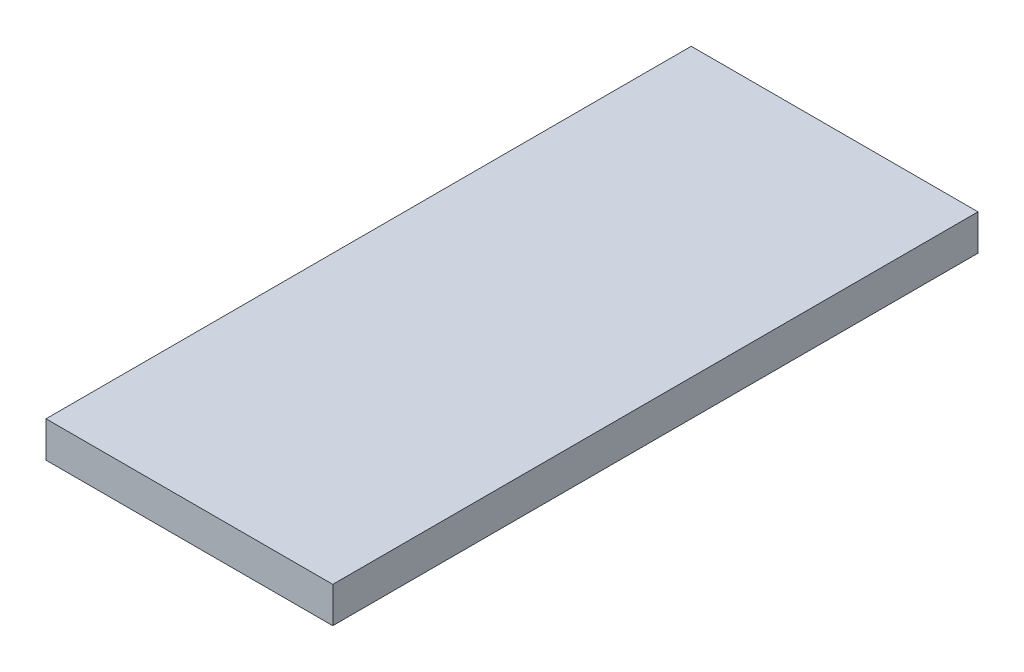
ISO-10303-21;
HEADER;
FILE_DESCRIPTION(('STEP AP214'),'2;1');
FILE_NAME('part.step','',(''),(''),'','','');
FILE_SCHEMA(('AUTOMOTIVE_DESIGN { 1 0 10303 214 1 1 1 1 }'));
ENDSEC;
DATA;
#1=APPLICATION_CONTEXT('core data for automotive mechanical design processes');
#2=APPLICATION_PROTOCOL_DEFINITION('international standard','automotive_design',2000,#1);
#3=PRODUCT_CONTEXT('',#1,'mechanical');
#4=PRODUCT('Part','Part','',(#3));
#5=PRODUCT_RELATED_PRODUCT_CATEGORY('part','',(#4));
#6=PRODUCT_DEFINITION_FORMATION('','',#4);
#7=PRODUCT_DEFINITION_CONTEXT('part definition',#1,'design');
#8=PRODUCT_DEFINITION('design','',#6,#7);
#9=PRODUCT_DEFINITION_SHAPE('','',#8);
#10=(LENGTH_UNIT() NAMED_UNIT(*) SI_UNIT(.MILLI.,.METRE.));
#11=(NAMED_UNIT(*) PLANE_ANGLE_UNIT() SI_UNIT($,.RADIAN.));
#12=(NAMED_UNIT(*) SI_UNIT($,.STERADIAN.) SOLID_ANGLE_UNIT());
#13=UNCERTAINTY_MEASURE_WITH_UNIT(LENGTH_MEASURE(1.E-05),#10,'distance_accuracy_value','');
#14=(GEOMETRIC_REPRESENTATION_CONTEXT(3) GLOBAL_UNCERTAINTY_ASSIGNED_CONTEXT((#13)) GLOBAL_UNIT_ASSIGNED_CONTEXT((#10,
#11,#12)) REPRESENTATION_CONTEXT('',''));
#15=CARTESIAN_POINT('',(0.,0.,0.));
#16=DIRECTION('',(0.,0.,1.));
#17=DIRECTION('',(1.,0.,0.));
#18=AXIS2_PLACEMENT_3D('',#15,#16,#17);
#19=CARTESIAN_POINT('',(40.,3.20370370370371,2.90740740740741));
#20=DIRECTION('',(0.,0.,-1.));
#21=DIRECTION('',(-1.,0.,0.));
#22=AXIS2_PLACEMENT_3D('',#19,#20,#21);
#23=PLANE('',#22);
#24=DIRECTION('',(0.,-1.,0.));
#25=VECTOR('',#24,1.);
#26=CARTESIAN_POINT('',(0.,3.20370370370371,2.90740740740741));
#27=LINE('',#26,#25);
#28=CARTESIAN_POINT('',(0.,3.20370370370371,2.90740740740741));
#29=VERTEX_POINT('',#28);
#30=CARTESIAN_POINT('',(0.,-1.79629629629629,2.90740740740741));
#31=VERTEX_POINT('',#30);
#32=EDGE_CURVE('E95',#29,#31,#27,.T.);
#33=ORIENTED_EDGE('',*,*,#32,.T.);
#34=DIRECTION('',(-1.,0.,0.));
#35=VECTOR('',#34,1.);
#36=CARTESIAN_POINT('',(40.,-1.79629629629629,2.90740740740741));
#37=LINE('',#36,#35);
#38=CARTESIAN_POINT('',(40.,-1.79629629629629,2.90740740740741));
#39=VERTEX_POINT('',#38);
#40=EDGE_CURVE('E11',#39,#31,#37,.T.);
#41=ORIENTED_EDGE('',*,*,#40,.F.);
#42=DIRECTION('',(0.,-1.,0.));
#43=VECTOR('',#42,1.);
#44=CARTESIAN_POINT('',(40.,3.20370370370371,2.90740740740741));
#45=LINE('',#44,#43);
#46=CARTESIAN_POINT('',(40.,3.20370370370371,2.90740740740741));
#47=VERTEX_POINT('',#46);
#48=EDGE_CURVE('E83',#47,#39,#45,.T.);
#49=ORIENTED_EDGE('',*,*,#48,.F.);
#50=DIRECTION('',(-1.,0.,0.));
#51=VECTOR('',#50,1.);
#52=CARTESIAN_POINT('',(40.,3.20370370370371,2.90740740740741));
#53=LINE('',#52,#51);
#54=EDGE_CURVE('E91',#47,#29,#53,.T.);
#55=ORIENTED_EDGE('',*,*,#54,.T.);
#56=EDGE_LOOP('',(#33,#41,#49,#55));
#57=FACE_BOUND('',#56,.T.);
#58=ADVANCED_FACE('F32',(#57),#23,.F.);
#59=CARTESIAN_POINT('',(40.,-1.79629629629629,2.90740740740741));
#60=DIRECTION('',(0.,1.,0.));
#61=DIRECTION('',(0.,0.,1.));
#62=AXIS2_PLACEMENT_3D('',#59,#60,#61);
#63=PLANE('',#62);
#64=DIRECTION('',(0.,0.,-1.));
#65=VECTOR('',#64,1.);
#66=CARTESIAN_POINT('',(0.,-1.79629629629629,2.90740740740741));
#67=LINE('',#66,#65);
#68=CARTESIAN_POINT('',(0.,-1.79629629629629,-87.0925925925926));
#69=VERTEX_POINT('',#68);
#70=EDGE_CURVE('E87',#31,#69,#67,.T.);
#71=ORIENTED_EDGE('',*,*,#70,.T.);
#72=DIRECTION('',(-1.,0.,0.));
#73=VECTOR('',#72,1.);
#74=CARTESIAN_POINT('',(40.,-1.79629629629629,-87.0925925925926));
#75=LINE('',#74,#73);
#76=CARTESIAN_POINT('',(40.,-1.79629629629629,-87.0925925925926));
#77=VERTEX_POINT('',#76);
#78=EDGE_CURVE('E40',#77,#69,#75,.T.);
#79=ORIENTED_EDGE('',*,*,#78,.F.);
#80=DIRECTION('',(0.,0.,-1.));
#81=VECTOR('',#80,1.);
#82=CARTESIAN_POINT('',(40.,-1.79629629629629,2.90740740740741));
#83=LINE('',#82,#81);
#84=EDGE_CURVE('E78',#39,#77,#83,.T.);
#85=ORIENTED_EDGE('',*,*,#84,.F.);
#86=ORIENTED_EDGE('',*,*,#40,.T.);
#87=EDGE_LOOP('',(#71,#79,#85,#86));
#88=FACE_BOUND('',#87,.T.);
#89=ADVANCED_FACE('F86',(#88),#63,.F.);
#90=CARTESIAN_POINT('',(40.,3.20370370370371,-87.0925925925926));
#91=DIRECTION('',(0.,0.,1.));
#92=DIRECTION('',(1.,0.,0.));
#93=AXIS2_PLACEMENT_3D('',#90,#91,#92);
#94=PLANE('',#93);
#95=DIRECTION('',(0.,1.,0.));
#96=VECTOR('',#95,1.);
#97=CARTESIAN_POINT('',(0.,3.20370370370371,-87.0925925925926));
#98=LINE('',#97,#96);
#99=CARTESIAN_POINT('',(0.,3.20370370370371,-87.0925925925926));
#100=VERTEX_POINT('',#99);
#101=EDGE_CURVE('E65',#69,#100,#98,.T.);
#102=ORIENTED_EDGE('',*,*,#101,.T.);
#103=DIRECTION('',(-1.,0.,0.));
#104=VECTOR('',#103,1.);
#105=CARTESIAN_POINT('',(40.,3.20370370370371,-87.0925925925926));
#106=LINE('',#105,#104);
#107=CARTESIAN_POINT('',(40.,3.20370370370371,-87.0925925925926));
#108=VERTEX_POINT('',#107);
#109=EDGE_CURVE('E88',#108,#100,#106,.T.);
#110=ORIENTED_EDGE('',*,*,#109,.F.);
#111=DIRECTION('',(0.,1.,0.));
#112=VECTOR('',#111,1.);
#113=CARTESIAN_POINT('',(40.,3.20370370370371,-87.0925925925926));
#114=LINE('',#113,#112);
#115=EDGE_CURVE('E81',#77,#108,#114,.T.);
#116=ORIENTED_EDGE('',*,*,#115,.F.);
#117=ORIENTED_EDGE('',*,*,#78,.T.);
#118=EDGE_LOOP('',(#102,#110,#116,#117));
#119=FACE_BOUND('',#118,.T.);
#120=ADVANCED_FACE('F89',(#119),#94,.F.);
#121=CARTESIAN_POINT('',(40.,3.20370370370371,2.90740740740741));
#122=DIRECTION('',(0.,-1.,0.));
#123=DIRECTION('',(0.,0.,-1.));
#124=AXIS2_PLACEMENT_3D('',#121,#122,#123);
#125=PLANE('',#124);
#126=DIRECTION('',(0.,0.,1.));
#127=VECTOR('',#126,1.);
#128=CARTESIAN_POINT('',(0.,3.20370370370371,2.90740740740741));
#129=LINE('',#128,#127);
#130=EDGE_CURVE('E71',#100,#29,#129,.T.);
#131=ORIENTED_EDGE('',*,*,#130,.T.);
#132=ORIENTED_EDGE('',*,*,#54,.F.);
#133=DIRECTION('',(0.,0.,1.));
#134=VECTOR('',#133,1.);
#135=CARTESIAN_POINT('',(40.,3.20370370370371,2.90740740740741));
#136=LINE('',#135,#134);
#137=EDGE_CURVE('E48',#108,#47,#136,.T.);
#138=ORIENTED_EDGE('',*,*,#137,.F.);
#139=ORIENTED_EDGE('',*,*,#109,.T.);
#140=EDGE_LOOP('',(#131,#132,#138,#139));
#141=FACE_BOUND('',#140,.T.);
#142=ADVANCED_FACE('F102',(#141),#125,.F.);
#143=CARTESIAN_POINT('',(40.,0.,0.));
#144=DIRECTION('',(1.,0.,0.));
#145=DIRECTION('',(0.,0.,-1.));
#146=AXIS2_PLACEMENT_3D('',#143,#144,#145);
#147=PLANE('',#146);
#148=ORIENTED_EDGE('',*,*,#48,.T.);
#149=ORIENTED_EDGE('',*,*,#84,.T.);
#150=ORIENTED_EDGE('',*,*,#115,.T.);
#151=ORIENTED_EDGE('',*,*,#137,.T.);
#152=EDGE_LOOP('',(#148,#149,#150,#151));
#153=FACE_BOUND('',#152,.T.);
#154=ADVANCED_FACE('F79',(#153),#147,.T.);
#155=CARTESIAN_POINT('',(0.,0.,0.));
#156=DIRECTION('',(1.,0.,0.));
#157=DIRECTION('',(0.,0.,-1.));
#158=AXIS2_PLACEMENT_3D('',#155,#156,#157);
#159=PLANE('',#158);
#160=ORIENTED_EDGE('',*,*,#32,.F.);
#161=ORIENTED_EDGE('',*,*,#130,.F.);
#162=ORIENTED_EDGE('',*,*,#101,.F.);
#163=ORIENTED_EDGE('',*,*,#70,.F.);
#164=EDGE_LOOP('',(#160,#161,#162,#163));
#165=FACE_BOUND('',#164,.T.);
#166=ADVANCED_FACE('F105',(#165),#159,.F.);
#167=CLOSED_SHELL('',(#58,#89,#120,#142,#154,#166));
#168=MANIFOLD_SOLID_BREP('B2',#167);
#169=ADVANCED_BREP_SHAPE_REPRESENTATION('',(#18,#168),#14);
#170=SHAPE_DEFINITION_REPRESENTATION(#9,#169);
ENDSEC;
END-ISO-10303-21;
